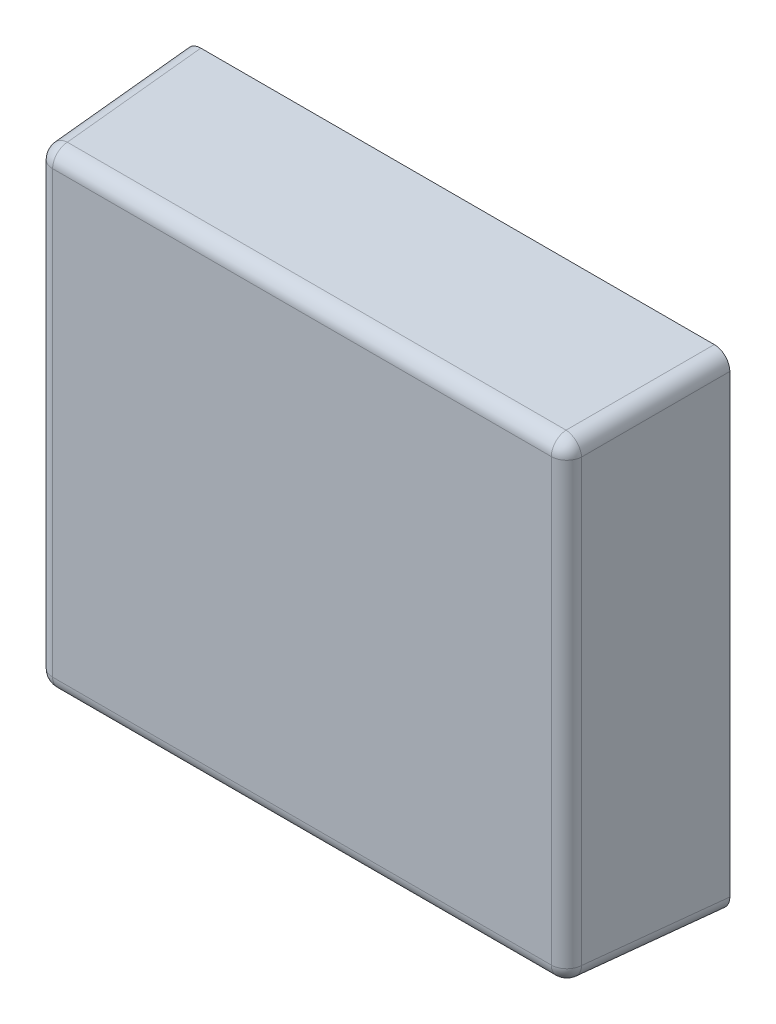
ISO-10303-21;
HEADER;
FILE_DESCRIPTION(('STEP AP214'),'2;1');
FILE_NAME('part.step','',(''),(''),'','','');
FILE_SCHEMA(('AUTOMOTIVE_DESIGN { 1 0 10303 214 1 1 1 1 }'));
ENDSEC;
DATA;
#1=APPLICATION_CONTEXT('core data for automotive mechanical design processes');
#2=APPLICATION_PROTOCOL_DEFINITION('international standard','automotive_design',2000,#1);
#3=PRODUCT_CONTEXT('',#1,'mechanical');
#4=PRODUCT('Part','Part','',(#3));
#5=PRODUCT_RELATED_PRODUCT_CATEGORY('part','',(#4));
#6=PRODUCT_DEFINITION_FORMATION('','',#4);
#7=PRODUCT_DEFINITION_CONTEXT('part definition',#1,'design');
#8=PRODUCT_DEFINITION('design','',#6,#7);
#9=PRODUCT_DEFINITION_SHAPE('','',#8);
#10=(LENGTH_UNIT() NAMED_UNIT(*) SI_UNIT(.MILLI.,.METRE.));
#11=(NAMED_UNIT(*) PLANE_ANGLE_UNIT() SI_UNIT($,.RADIAN.));
#12=(NAMED_UNIT(*) SI_UNIT($,.STERADIAN.) SOLID_ANGLE_UNIT());
#13=UNCERTAINTY_MEASURE_WITH_UNIT(LENGTH_MEASURE(1.E-05),#10,'distance_accuracy_value','');
#14=(GEOMETRIC_REPRESENTATION_CONTEXT(3) GLOBAL_UNCERTAINTY_ASSIGNED_CONTEXT((#13)) GLOBAL_UNIT_ASSIGNED_CONTEXT((#10,
#11,#12)) REPRESENTATION_CONTEXT('',''));
#15=CARTESIAN_POINT('',(0.,0.,0.));
#16=DIRECTION('',(0.,0.,1.));
#17=DIRECTION('',(1.,0.,0.));
#18=AXIS2_PLACEMENT_3D('',#15,#16,#17);
#19=CARTESIAN_POINT('',(-0.7,-0.625,0.4));
#20=DIRECTION('',(0.,0.,1.));
#21=DIRECTION('',(1.,0.,0.));
#22=AXIS2_PLACEMENT_3D('',#19,#20,#21);
#23=PLANE('',#22);
#24=DIRECTION('',(0.,1.,0.));
#25=VECTOR('',#24,1.);
#26=CARTESIAN_POINT('',(-0.641078305618,-0.625,0.4));
#27=LINE('',#26,#25);
#28=CARTESIAN_POINT('',(-0.641078305618,-0.566078305618,0.4));
#29=VERTEX_POINT('',#28);
#30=CARTESIAN_POINT('',(-0.641078305618,0.566078305618,0.4));
#31=VERTEX_POINT('',#30);
#32=EDGE_CURVE('E99',#29,#31,#27,.T.);
#33=ORIENTED_EDGE('',*,*,#32,.F.);
#34=DIRECTION('',(-1.,0.,0.));
#35=VECTOR('',#34,1.);
#36=CARTESIAN_POINT('',(-0.7,-0.566078305618,0.4));
#37=LINE('',#36,#35);
#38=CARTESIAN_POINT('',(0.641078305618,-0.566078305618,0.4));
#39=VERTEX_POINT('',#38);
#40=EDGE_CURVE('E101',#39,#29,#37,.T.);
#41=ORIENTED_EDGE('',*,*,#40,.F.);
#42=DIRECTION('',(0.,-1.,0.));
#43=VECTOR('',#42,1.);
#44=CARTESIAN_POINT('',(0.641078305618,-0.625,0.4));
#45=LINE('',#44,#43);
#46=CARTESIAN_POINT('',(0.641078305618,0.566078305618,0.4));
#47=VERTEX_POINT('',#46);
#48=EDGE_CURVE('E93',#47,#39,#45,.T.);
#49=ORIENTED_EDGE('',*,*,#48,.F.);
#50=DIRECTION('',(1.,0.,0.));
#51=VECTOR('',#50,1.);
#52=CARTESIAN_POINT('',(-0.7,0.566078305618,0.4));
#53=LINE('',#52,#51);
#54=EDGE_CURVE('E103',#31,#47,#53,.T.);
#55=ORIENTED_EDGE('',*,*,#54,.F.);
#56=EDGE_LOOP('',(#33,#41,#49,#55));
#57=FACE_BOUND('',#56,.T.);
#58=ADVANCED_FACE('F17',(#57),#23,.T.);
#59=CARTESIAN_POINT('',(-0.641078305618,0.566078305618,0.36));
#60=DIRECTION('',(1.,0.,0.));
#61=DIRECTION('',(0.,1.,0.));
#62=AXIS2_PLACEMENT_3D('',#59,#60,#61);
#63=SPHERICAL_SURFACE('',#62,0.04);
#64=CARTESIAN_POINT('',(-0.641078305618,0.566078305618,0.36));
#65=DIRECTION('',(0.,1.,0.));
#66=DIRECTION('',(0.,0.,1.));
#67=AXIS2_PLACEMENT_3D('',#64,#65,#66);
#68=CIRCLE('',#67,0.04);
#69=CARTESIAN_POINT('',(-0.681023487008266,0.566078305618001,0.362093438250014));
#70=VERTEX_POINT('',#69);
#71=EDGE_CURVE('E84',#31,#70,#68,.F.);
#72=ORIENTED_EDGE('',*,*,#71,.F.);
#73=CARTESIAN_POINT('',(-0.641078305618,0.566078305618,0.36));
#74=DIRECTION('',(1.,0.,0.));
#75=DIRECTION('',(0.,1.,0.));
#76=AXIS2_PLACEMENT_3D('',#73,#74,#75);
#77=CIRCLE('',#76,0.04);
#78=CARTESIAN_POINT('',(-0.641078305618,0.606023487008274,0.362093438250014));
#79=VERTEX_POINT('',#78);
#80=EDGE_CURVE('E153',#79,#31,#77,.T.);
#81=ORIENTED_EDGE('',*,*,#80,.F.);
#82=CARTESIAN_POINT('',(-0.641078305618197,0.566078305618197,0.360000000000312));
#83=DIRECTION('',(0.0522644276887224,-0.0522644276887224,0.997264688634236));
#84=DIRECTION('',(0.998629534754573,0.,-0.0523359562429523));
#85=AXIS2_PLACEMENT_3D('',#82,#83,#84);
#86=CIRCLE('',#85,0.04);
#87=EDGE_CURVE('E20',#70,#79,#86,.F.);
#88=ORIENTED_EDGE('',*,*,#87,.F.);
#89=EDGE_LOOP('',(#72,#81,#88));
#90=FACE_BOUND('',#89,.T.);
#91=ADVANCED_FACE('F142',(#90),#63,.T.);
#92=CARTESIAN_POINT('',(-0.641078305618,-0.625,0.36));
#93=DIRECTION('',(0.,1.,0.));
#94=DIRECTION('',(0.,0.,1.));
#95=AXIS2_PLACEMENT_3D('',#92,#93,#94);
#96=CYLINDRICAL_SURFACE('',#95,0.04);
#97=ORIENTED_EDGE('',*,*,#71,.T.);
#98=DIRECTION('',(0.,1.,0.));
#99=VECTOR('',#98,1.);
#100=CARTESIAN_POINT('',(-0.681023487008365,0.,0.362093438250019));
#101=LINE('',#100,#99);
#102=CARTESIAN_POINT('',(-0.681023487008335,-0.566078305618,0.362093438250017));
#103=VERTEX_POINT('',#102);
#104=EDGE_CURVE('E108',#103,#70,#101,.T.);
#105=ORIENTED_EDGE('',*,*,#104,.F.);
#106=CARTESIAN_POINT('',(-0.641078305618,-0.566078305618,0.36));
#107=DIRECTION('',(0.,-1.,0.));
#108=DIRECTION('',(1.,0.,0.));
#109=AXIS2_PLACEMENT_3D('',#106,#107,#108);
#110=CIRCLE('',#109,0.04);
#111=EDGE_CURVE('E106',#29,#103,#110,.T.);
#112=ORIENTED_EDGE('',*,*,#111,.F.);
#113=ORIENTED_EDGE('',*,*,#32,.T.);
#114=EDGE_LOOP('',(#97,#105,#112,#113));
#115=FACE_BOUND('',#114,.T.);
#116=ADVANCED_FACE('F107',(#115),#96,.T.);
#117=CARTESIAN_POINT('',(-0.641078305618,-0.566078305618,0.36));
#118=DIRECTION('',(1.,0.,0.));
#119=DIRECTION('',(0.,1.,0.));
#120=AXIS2_PLACEMENT_3D('',#117,#118,#119);
#121=SPHERICAL_SURFACE('',#120,0.04);
#122=CARTESIAN_POINT('',(-0.641078305618319,-0.566078305618319,0.360000000000325));
#123=DIRECTION('',(0.0522644276887224,0.0522644276887224,0.997264688634236));
#124=DIRECTION('',(0.998629534754573,0.,-0.0523359562429523));
#125=AXIS2_PLACEMENT_3D('',#122,#123,#124);
#126=CIRCLE('',#125,0.04);
#127=CARTESIAN_POINT('',(-0.641078305618002,-0.606023487008266,0.362093438250014));
#128=VERTEX_POINT('',#127);
#129=EDGE_CURVE('E123',#128,#103,#126,.F.);
#130=ORIENTED_EDGE('',*,*,#129,.F.);
#131=CARTESIAN_POINT('',(-0.641078305618,-0.566078305618,0.36));
#132=DIRECTION('',(-1.,0.,0.));
#133=DIRECTION('',(0.,-1.,0.));
#134=AXIS2_PLACEMENT_3D('',#131,#132,#133);
#135=CIRCLE('',#134,0.04);
#136=EDGE_CURVE('E114',#29,#128,#135,.F.);
#137=ORIENTED_EDGE('',*,*,#136,.F.);
#138=ORIENTED_EDGE('',*,*,#111,.T.);
#139=EDGE_LOOP('',(#130,#137,#138));
#140=FACE_BOUND('',#139,.T.);
#141=ADVANCED_FACE('F122',(#140),#121,.T.);
#142=CARTESIAN_POINT('',(-0.7,-0.566078305618,0.36));
#143=DIRECTION('',(-1.,0.,0.));
#144=DIRECTION('',(0.,-1.,0.));
#145=AXIS2_PLACEMENT_3D('',#142,#143,#144);
#146=CYLINDRICAL_SURFACE('',#145,0.04);
#147=CARTESIAN_POINT('',(0.641078305618,-0.566078305618,0.36));
#148=DIRECTION('',(1.,0.,0.));
#149=DIRECTION('',(0.,1.,0.));
#150=AXIS2_PLACEMENT_3D('',#147,#148,#149);
#151=CIRCLE('',#150,0.04);
#152=CARTESIAN_POINT('',(0.641078305618,-0.606023487008274,0.362093438250014));
#153=VERTEX_POINT('',#152);
#154=EDGE_CURVE('E120',#39,#153,#151,.T.);
#155=ORIENTED_EDGE('',*,*,#154,.F.);
#156=ORIENTED_EDGE('',*,*,#40,.T.);
#157=ORIENTED_EDGE('',*,*,#136,.T.);
#158=DIRECTION('',(1.,0.,0.));
#159=VECTOR('',#158,1.);
#160=CARTESIAN_POINT('',(0.,-0.606023487008365,0.362093438250019));
#161=LINE('',#160,#159);
#162=EDGE_CURVE('E195',#153,#128,#161,.F.);
#163=ORIENTED_EDGE('',*,*,#162,.F.);
#164=EDGE_LOOP('',(#155,#156,#157,#163));
#165=FACE_BOUND('',#164,.T.);
#166=ADVANCED_FACE('F117',(#165),#146,.T.);
#167=CARTESIAN_POINT('',(0.641078305618,-0.566078305618,0.36));
#168=DIRECTION('',(1.,0.,0.));
#169=DIRECTION('',(0.,1.,0.));
#170=AXIS2_PLACEMENT_3D('',#167,#168,#169);
#171=SPHERICAL_SURFACE('',#170,0.04);
#172=CARTESIAN_POINT('',(0.641078305618197,-0.566078305618197,0.360000000000312));
#173=DIRECTION('',(-0.0522644276887224,0.0522644276887224,0.997264688634236));
#174=DIRECTION('',(0.998629534754573,0.,0.0523359562429523));
#175=AXIS2_PLACEMENT_3D('',#172,#173,#174);
#176=CIRCLE('',#175,0.04);
#177=CARTESIAN_POINT('',(0.681023487008266,-0.566078305618002,0.362093438250014));
#178=VERTEX_POINT('',#177);
#179=EDGE_CURVE('E189',#178,#153,#176,.F.);
#180=ORIENTED_EDGE('',*,*,#179,.F.);
#181=CARTESIAN_POINT('',(0.641078305618,-0.566078305618,0.36));
#182=DIRECTION('',(0.,-1.,0.));
#183=DIRECTION('',(1.,0.,0.));
#184=AXIS2_PLACEMENT_3D('',#181,#182,#183);
#185=CIRCLE('',#184,0.04);
#186=EDGE_CURVE('E158',#39,#178,#185,.F.);
#187=ORIENTED_EDGE('',*,*,#186,.F.);
#188=ORIENTED_EDGE('',*,*,#154,.T.);
#189=EDGE_LOOP('',(#180,#187,#188));
#190=FACE_BOUND('',#189,.T.);
#191=ADVANCED_FACE('F226',(#190),#171,.T.);
#192=CARTESIAN_POINT('',(0.641078305618,-0.625,0.36));
#193=DIRECTION('',(0.,-1.,0.));
#194=DIRECTION('',(1.,0.,0.));
#195=AXIS2_PLACEMENT_3D('',#192,#193,#194);
#196=CYLINDRICAL_SURFACE('',#195,0.04);
#197=CARTESIAN_POINT('',(0.641078305618,0.566078305618,0.36));
#198=DIRECTION('',(0.,-1.,0.));
#199=DIRECTION('',(1.,0.,0.));
#200=AXIS2_PLACEMENT_3D('',#197,#198,#199);
#201=CIRCLE('',#200,0.04);
#202=CARTESIAN_POINT('',(0.681023487008335,0.566078305618159,0.362093438250026));
#203=VERTEX_POINT('',#202);
#204=EDGE_CURVE('E157',#47,#203,#201,.F.);
#205=ORIENTED_EDGE('',*,*,#204,.F.);
#206=ORIENTED_EDGE('',*,*,#48,.T.);
#207=ORIENTED_EDGE('',*,*,#186,.T.);
#208=DIRECTION('',(0.,1.,0.));
#209=VECTOR('',#208,1.);
#210=CARTESIAN_POINT('',(0.681023487008365,0.,0.362093438250019));
#211=LINE('',#210,#209);
#212=EDGE_CURVE('E188',#203,#178,#211,.F.);
#213=ORIENTED_EDGE('',*,*,#212,.F.);
#214=EDGE_LOOP('',(#205,#206,#207,#213));
#215=FACE_BOUND('',#214,.T.);
#216=ADVANCED_FACE('F222',(#215),#196,.T.);
#217=CARTESIAN_POINT('',(0.641078305618,0.566078305618,0.36));
#218=DIRECTION('',(1.,0.,0.));
#219=DIRECTION('',(0.,1.,0.));
#220=AXIS2_PLACEMENT_3D('',#217,#218,#219);
#221=SPHERICAL_SURFACE('',#220,0.04);
#222=ORIENTED_EDGE('',*,*,#204,.T.);
#223=CARTESIAN_POINT('',(0.641078305618319,0.566078305618319,0.360000000000325));
#224=DIRECTION('',(-0.0522644276887224,-0.0522644276887224,0.997264688634236));
#225=DIRECTION('',(0.998629534754573,0.,0.0523359562429523));
#226=AXIS2_PLACEMENT_3D('',#223,#224,#225);
#227=CIRCLE('',#226,0.04);
#228=CARTESIAN_POINT('',(0.641078305618002,0.606023487008266,0.362093438250014));
#229=VERTEX_POINT('',#228);
#230=EDGE_CURVE('E183',#229,#203,#227,.F.);
#231=ORIENTED_EDGE('',*,*,#230,.F.);
#232=CARTESIAN_POINT('',(0.641078305618,0.566078305618,0.36));
#233=DIRECTION('',(1.,0.,0.));
#234=DIRECTION('',(0.,1.,0.));
#235=AXIS2_PLACEMENT_3D('',#232,#233,#234);
#236=CIRCLE('',#235,0.04);
#237=EDGE_CURVE('E152',#47,#229,#236,.F.);
#238=ORIENTED_EDGE('',*,*,#237,.F.);
#239=EDGE_LOOP('',(#222,#231,#238));
#240=FACE_BOUND('',#239,.T.);
#241=ADVANCED_FACE('F217',(#240),#221,.T.);
#242=CARTESIAN_POINT('',(-0.7,0.566078305618,0.36));
#243=DIRECTION('',(1.,0.,0.));
#244=DIRECTION('',(0.,1.,0.));
#245=AXIS2_PLACEMENT_3D('',#242,#243,#244);
#246=CYLINDRICAL_SURFACE('',#245,0.04);
#247=ORIENTED_EDGE('',*,*,#237,.T.);
#248=DIRECTION('',(1.,0.,0.));
#249=VECTOR('',#248,1.);
#250=CARTESIAN_POINT('',(0.,0.606023487008365,0.362093438250019));
#251=LINE('',#250,#249);
#252=EDGE_CURVE('E182',#79,#229,#251,.T.);
#253=ORIENTED_EDGE('',*,*,#252,.F.);
#254=ORIENTED_EDGE('',*,*,#80,.T.);
#255=ORIENTED_EDGE('',*,*,#54,.T.);
#256=EDGE_LOOP('',(#247,#253,#254,#255));
#257=FACE_BOUND('',#256,.T.);
#258=ADVANCED_FACE('F221',(#257),#246,.T.);
#259=CARTESIAN_POINT('',(-0.658456700184,0.583456700184,0.02840047787701));
#260=DIRECTION('',(0.0522644276887224,-0.0522644276887224,0.997264688634236));
#261=DIRECTION('',(0.998629534754573,0.,-0.0523359562429523));
#262=AXIS2_PLACEMENT_3D('',#259,#260,#261);
#263=CYLINDRICAL_SURFACE('',#262,0.04);
#264=ORIENTED_EDGE('',*,*,#87,.T.);
#265=DIRECTION('',(0.0522644276896903,-0.0522644276886852,0.997264688634188));
#266=VECTOR('',#265,1.);
#267=CARTESIAN_POINT('',(-0.66005481861,0.625,0.));
#268=LINE('',#267,#266);
#269=CARTESIAN_POINT('',(-0.660054818609923,0.625000000000014,0.));
#270=VERTEX_POINT('',#269);
#271=EDGE_CURVE('E179',#270,#79,#268,.T.);
#272=ORIENTED_EDGE('',*,*,#271,.F.);
#273=CARTESIAN_POINT('',(-0.659945106160111,0.584945106160111,0.));
#274=DIRECTION('',(0.,0.,1.));
#275=DIRECTION('',(0.707106781186548,-0.707106781186548,0.));
#276=AXIS2_PLACEMENT_3D('',#273,#274,#275);
#277=ELLIPSE('',#276,0.0401097125526227,0.04);
#278=CARTESIAN_POINT('',(-0.700000000000014,0.585054818609923,0.));
#279=VERTEX_POINT('',#278);
#280=EDGE_CURVE('E176',#270,#279,#277,.T.);
#281=ORIENTED_EDGE('',*,*,#280,.T.);
#282=DIRECTION('',(-0.0522644276886852,0.0522644276896903,-0.997264688634188));
#283=VECTOR('',#282,1.);
#284=CARTESIAN_POINT('',(-0.681023487008365,0.566078305618,0.362093438250019));
#285=LINE('',#284,#283);
#286=EDGE_CURVE('E133',#70,#279,#285,.T.);
#287=ORIENTED_EDGE('',*,*,#286,.F.);
#288=EDGE_LOOP('',(#264,#272,#281,#287));
#289=FACE_BOUND('',#288,.T.);
#290=ADVANCED_FACE('F277',(#289),#263,.T.);
#291=CARTESIAN_POINT('',(-0.7,0.,0.));
#292=DIRECTION('',(-0.998629534754575,0.,0.0523359562429177));
#293=DIRECTION('',(0.0523359562429177,0.,0.998629534754575));
#294=AXIS2_PLACEMENT_3D('',#291,#292,#293);
#295=PLANE('',#294);
#296=DIRECTION('',(0.,1.,0.));
#297=VECTOR('',#296,1.);
#298=CARTESIAN_POINT('',(-0.7,-0.625,0.));
#299=LINE('',#298,#297);
#300=CARTESIAN_POINT('',(-0.700000000000113,-0.585054818609808,0.));
#301=VERTEX_POINT('',#300);
#302=EDGE_CURVE('E175',#279,#301,#299,.F.);
#303=ORIENTED_EDGE('',*,*,#302,.T.);
#304=DIRECTION('',(0.0522644276887224,0.0522644276887224,0.997264688634236));
#305=VECTOR('',#304,1.);
#306=CARTESIAN_POINT('',(-0.698197013794184,-0.583251832403681,0.0344030262421314));
#307=LINE('',#306,#305);
#308=EDGE_CURVE('E193',#103,#301,#307,.F.);
#309=ORIENTED_EDGE('',*,*,#308,.F.);
#310=ORIENTED_EDGE('',*,*,#104,.T.);
#311=ORIENTED_EDGE('',*,*,#286,.T.);
#312=EDGE_LOOP('',(#303,#309,#310,#311));
#313=FACE_BOUND('',#312,.T.);
#314=ADVANCED_FACE('F281',(#313),#295,.T.);
#315=CARTESIAN_POINT('',(-0.658251832404,-0.583251832404,0.03230958799243));
#316=DIRECTION('',(0.0522644276887224,0.0522644276887224,0.997264688634236));
#317=DIRECTION('',(0.998629534754573,0.,-0.0523359562429523));
#318=AXIS2_PLACEMENT_3D('',#315,#316,#317);
#319=CYLINDRICAL_SURFACE('',#318,0.04);
#320=CARTESIAN_POINT('',(-0.659945106160234,-0.584945106160234,0.));
#321=DIRECTION('',(0.,0.,1.));
#322=DIRECTION('',(0.707106781186548,0.707106781186548,0.));
#323=AXIS2_PLACEMENT_3D('',#320,#321,#322);
#324=ELLIPSE('',#323,0.0401097125526227,0.04);
#325=CARTESIAN_POINT('',(-0.660054818609984,-0.625000000000075,0.));
#326=VERTEX_POINT('',#325);
#327=EDGE_CURVE('E172',#301,#326,#324,.T.);
#328=ORIENTED_EDGE('',*,*,#327,.T.);
#329=DIRECTION('',(-0.0522644276896903,-0.0522644276886852,-0.997264688634188));
#330=VECTOR('',#329,1.);
#331=CARTESIAN_POINT('',(-0.641078305618,-0.606023487008365,0.362093438250019));
#332=LINE('',#331,#330);
#333=EDGE_CURVE('E192',#128,#326,#332,.T.);
#334=ORIENTED_EDGE('',*,*,#333,.F.);
#335=ORIENTED_EDGE('',*,*,#129,.T.);
#336=ORIENTED_EDGE('',*,*,#308,.T.);
#337=EDGE_LOOP('',(#328,#334,#335,#336));
#338=FACE_BOUND('',#337,.T.);
#339=ADVANCED_FACE('F287',(#338),#319,.T.);
#340=CARTESIAN_POINT('',(0.,-0.625,0.));
#341=DIRECTION('',(0.,-0.998629534754575,0.0523359562429177));
#342=DIRECTION('',(0.,-0.0523359562429177,-0.998629534754575));
#343=AXIS2_PLACEMENT_3D('',#340,#341,#342);
#344=PLANE('',#343);
#345=ORIENTED_EDGE('',*,*,#162,.T.);
#346=ORIENTED_EDGE('',*,*,#333,.T.);
#347=DIRECTION('',(1.,0.,0.));
#348=VECTOR('',#347,1.);
#349=CARTESIAN_POINT('',(-0.7,-0.625,0.));
#350=LINE('',#349,#348);
#351=CARTESIAN_POINT('',(0.660054818609747,-0.625000000000021,0.));
#352=VERTEX_POINT('',#351);
#353=EDGE_CURVE('E171',#326,#352,#350,.T.);
#354=ORIENTED_EDGE('',*,*,#353,.T.);
#355=DIRECTION('',(-0.0522644276887224,0.0522644276887224,0.997264688634236));
#356=VECTOR('',#355,1.);
#357=CARTESIAN_POINT('',(0.658456700183803,-0.623401881574183,0.0304939161267178));
#358=LINE('',#357,#356);
#359=EDGE_CURVE('E191',#153,#352,#358,.F.);
#360=ORIENTED_EDGE('',*,*,#359,.F.);
#361=EDGE_LOOP('',(#345,#346,#354,#360));
#362=FACE_BOUND('',#361,.T.);
#363=ADVANCED_FACE('F258',(#362),#344,.T.);
#364=CARTESIAN_POINT('',(0.658456700184,-0.583456700184,0.02840047787701));
#365=DIRECTION('',(-0.0522644276887224,0.0522644276887224,0.997264688634236));
#366=DIRECTION('',(0.998629534754573,0.,0.0523359562429523));
#367=AXIS2_PLACEMENT_3D('',#364,#365,#366);
#368=CYLINDRICAL_SURFACE('',#367,0.04);
#369=ORIENTED_EDGE('',*,*,#179,.T.);
#370=ORIENTED_EDGE('',*,*,#359,.T.);
#371=CARTESIAN_POINT('',(0.659945106160111,-0.584945106160111,0.));
#372=DIRECTION('',(0.,0.,1.));
#373=DIRECTION('',(-0.707106781186548,0.707106781186548,0.));
#374=AXIS2_PLACEMENT_3D('',#371,#372,#373);
#375=ELLIPSE('',#374,0.0401097125526227,0.04);
#376=CARTESIAN_POINT('',(0.700000000000014,-0.585054818609923,0.));
#377=VERTEX_POINT('',#376);
#378=EDGE_CURVE('E168',#352,#377,#375,.T.);
#379=ORIENTED_EDGE('',*,*,#378,.T.);
#380=DIRECTION('',(-0.0522644276886852,0.0522644276896903,0.997264688634188));
#381=VECTOR('',#380,1.);
#382=CARTESIAN_POINT('',(0.7,-0.58505481861,0.));
#383=LINE('',#382,#381);
#384=EDGE_CURVE('E186',#178,#377,#383,.F.);
#385=ORIENTED_EDGE('',*,*,#384,.F.);
#386=EDGE_LOOP('',(#369,#370,#379,#385));
#387=FACE_BOUND('',#386,.T.);
#388=ADVANCED_FACE('F248',(#387),#368,.T.);
#389=CARTESIAN_POINT('',(0.7,0.,0.));
#390=DIRECTION('',(0.998629534754575,0.,0.0523359562429177));
#391=DIRECTION('',(0.0523359562429177,0.,-0.998629534754575));
#392=AXIS2_PLACEMENT_3D('',#389,#390,#391);
#393=PLANE('',#392);
#394=ORIENTED_EDGE('',*,*,#212,.T.);
#395=ORIENTED_EDGE('',*,*,#384,.T.);
#396=DIRECTION('',(0.,1.,0.));
#397=VECTOR('',#396,1.);
#398=CARTESIAN_POINT('',(0.7,-0.625,0.));
#399=LINE('',#398,#397);
#400=CARTESIAN_POINT('',(0.700000000000075,0.585054818609967,0.));
#401=VERTEX_POINT('',#400);
#402=EDGE_CURVE('E167',#377,#401,#399,.T.);
#403=ORIENTED_EDGE('',*,*,#402,.T.);
#404=DIRECTION('',(0.0522644276886879,0.0522644276887223,-0.997264688634238));
#405=VECTOR('',#404,1.);
#406=CARTESIAN_POINT('',(0.681023487008364,0.566078305618319,0.362093438250036));
#407=LINE('',#406,#405);
#408=EDGE_CURVE('E180',#203,#401,#407,.T.);
#409=ORIENTED_EDGE('',*,*,#408,.F.);
#410=EDGE_LOOP('',(#394,#395,#403,#409));
#411=FACE_BOUND('',#410,.T.);
#412=ADVANCED_FACE('F243',(#411),#393,.T.);
#413=CARTESIAN_POINT('',(0.658251832404,0.583251832404,0.03230958799243));
#414=DIRECTION('',(-0.0522644276887224,-0.0522644276887224,0.997264688634236));
#415=DIRECTION('',(0.998629534754573,0.,0.0523359562429523));
#416=AXIS2_PLACEMENT_3D('',#413,#414,#415);
#417=CYLINDRICAL_SURFACE('',#416,0.04);
#418=CARTESIAN_POINT('',(0.659945106160234,0.584945106160234,0.));
#419=DIRECTION('',(0.,0.,1.));
#420=DIRECTION('',(-0.707106781186548,-0.707106781186548,0.));
#421=AXIS2_PLACEMENT_3D('',#418,#419,#420);
#422=ELLIPSE('',#421,0.0401097125526227,0.04);
#423=CARTESIAN_POINT('',(0.660054818609984,0.625000000000075,0.));
#424=VERTEX_POINT('',#423);
#425=EDGE_CURVE('E26',#401,#424,#422,.T.);
#426=ORIENTED_EDGE('',*,*,#425,.T.);
#427=DIRECTION('',(0.0522644276896903,0.0522644276886852,-0.997264688634188));
#428=VECTOR('',#427,1.);
#429=CARTESIAN_POINT('',(0.641078305618,0.606023487008365,0.362093438250019));
#430=LINE('',#429,#428);
#431=EDGE_CURVE('E34',#229,#424,#430,.T.);
#432=ORIENTED_EDGE('',*,*,#431,.F.);
#433=ORIENTED_EDGE('',*,*,#230,.T.);
#434=ORIENTED_EDGE('',*,*,#408,.T.);
#435=EDGE_LOOP('',(#426,#432,#433,#434));
#436=FACE_BOUND('',#435,.T.);
#437=ADVANCED_FACE('F276',(#436),#417,.T.);
#438=CARTESIAN_POINT('',(0.,0.625,0.));
#439=DIRECTION('',(0.,0.998629534754575,0.0523359562429177));
#440=DIRECTION('',(0.,-0.0523359562429177,0.998629534754575));
#441=AXIS2_PLACEMENT_3D('',#438,#439,#440);
#442=PLANE('',#441);
#443=DIRECTION('',(1.,0.,0.));
#444=VECTOR('',#443,1.);
#445=CARTESIAN_POINT('',(-0.7,0.625,0.));
#446=LINE('',#445,#444);
#447=EDGE_CURVE('E11',#424,#270,#446,.F.);
#448=ORIENTED_EDGE('',*,*,#447,.T.);
#449=ORIENTED_EDGE('',*,*,#271,.T.);
#450=ORIENTED_EDGE('',*,*,#252,.T.);
#451=ORIENTED_EDGE('',*,*,#431,.T.);
#452=EDGE_LOOP('',(#448,#449,#450,#451));
#453=FACE_BOUND('',#452,.T.);
#454=ADVANCED_FACE('F268',(#453),#442,.T.);
#455=CARTESIAN_POINT('',(-0.7,-0.625,0.));
#456=DIRECTION('',(0.,0.,1.));
#457=DIRECTION('',(1.,0.,0.));
#458=AXIS2_PLACEMENT_3D('',#455,#456,#457);
#459=PLANE('',#458);
#460=ORIENTED_EDGE('',*,*,#425,.F.);
#461=ORIENTED_EDGE('',*,*,#402,.F.);
#462=ORIENTED_EDGE('',*,*,#378,.F.);
#463=ORIENTED_EDGE('',*,*,#353,.F.);
#464=ORIENTED_EDGE('',*,*,#327,.F.);
#465=ORIENTED_EDGE('',*,*,#302,.F.);
#466=ORIENTED_EDGE('',*,*,#280,.F.);
#467=ORIENTED_EDGE('',*,*,#447,.F.);
#468=EDGE_LOOP('',(#460,#461,#462,#463,#464,#465,#466,#467));
#469=FACE_BOUND('',#468,.T.);
#470=ADVANCED_FACE('F255',(#469),#459,.F.);
#471=CLOSED_SHELL('',(#58,#91,#116,#141,#166,#191,#216,#241,#258,#290,#314,#339,#363,#388,#412,
#437,#454,#470));
#472=MANIFOLD_SOLID_BREP('B1',#471);
#473=ADVANCED_BREP_SHAPE_REPRESENTATION('',(#18,#472),#14);
#474=SHAPE_DEFINITION_REPRESENTATION(#9,#473);
ENDSEC;
END-ISO-10303-21;
